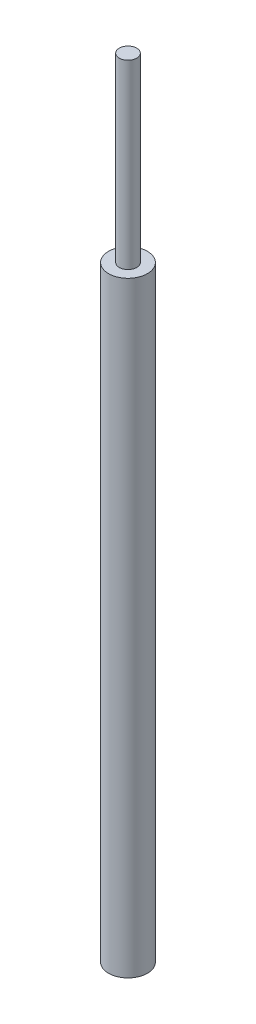
ISO-10303-21;
HEADER;
FILE_DESCRIPTION(('STEP AP214'),'2;1');
FILE_NAME('part.step','',(''),(''),'','','');
FILE_SCHEMA(('AUTOMOTIVE_DESIGN { 1 0 10303 214 1 1 1 1 }'));
ENDSEC;
DATA;
#1=APPLICATION_CONTEXT('core data for automotive mechanical design processes');
#2=APPLICATION_PROTOCOL_DEFINITION('international standard','automotive_design',2000,#1);
#3=PRODUCT_CONTEXT('',#1,'mechanical');
#4=PRODUCT('Part','Part','',(#3));
#5=PRODUCT_RELATED_PRODUCT_CATEGORY('part','',(#4));
#6=PRODUCT_DEFINITION_FORMATION('','',#4);
#7=PRODUCT_DEFINITION_CONTEXT('part definition',#1,'design');
#8=PRODUCT_DEFINITION('design','',#6,#7);
#9=PRODUCT_DEFINITION_SHAPE('','',#8);
#10=(LENGTH_UNIT() NAMED_UNIT(*) SI_UNIT(.MILLI.,.METRE.));
#11=(NAMED_UNIT(*) PLANE_ANGLE_UNIT() SI_UNIT($,.RADIAN.));
#12=(NAMED_UNIT(*) SI_UNIT($,.STERADIAN.) SOLID_ANGLE_UNIT());
#13=UNCERTAINTY_MEASURE_WITH_UNIT(LENGTH_MEASURE(1.E-05),#10,'distance_accuracy_value','');
#14=(GEOMETRIC_REPRESENTATION_CONTEXT(3) GLOBAL_UNCERTAINTY_ASSIGNED_CONTEXT((#13)) GLOBAL_UNIT_ASSIGNED_CONTEXT((#10,
#11,#12)) REPRESENTATION_CONTEXT('',''));
#15=CARTESIAN_POINT('',(0.,0.,0.));
#16=DIRECTION('',(0.,0.,1.));
#17=DIRECTION('',(1.,0.,0.));
#18=AXIS2_PLACEMENT_3D('',#15,#16,#17);
#19=CARTESIAN_POINT('',(-17.9578,-3.3782,0.5588));
#20=DIRECTION('',(0.,1.,0.));
#21=DIRECTION('',(1.,0.,0.));
#22=AXIS2_PLACEMENT_3D('',#19,#20,#21);
#23=PLANE('',#22);
#24=CARTESIAN_POINT('',(-17.9578,-3.3782,0.5588));
#25=DIRECTION('',(0.,1.,0.));
#26=DIRECTION('',(-0.693946000875941,0.,-0.720027046622756));
#27=AXIS2_PLACEMENT_3D('',#24,#25,#26);
#28=CIRCLE('',#27,0.2286);
#29=CARTESIAN_POINT('',(-17.7991639441998,-3.3782,0.723398182857962));
#30=VERTEX_POINT('',#29);
#31=EDGE_CURVE('E21',#30,#30,#28,.T.);
#32=ORIENTED_EDGE('',*,*,#31,.T.);
#33=EDGE_LOOP('',(#32));
#34=FACE_BOUND('',#33,.T.);
#35=ADVANCED_FACE('F17',(#34),#23,.T.);
#36=CARTESIAN_POINT('',(-17.9578,-24.003,0.5588));
#37=DIRECTION('',(0.,1.,0.));
#38=DIRECTION('',(1.,0.,0.));
#39=AXIS2_PLACEMENT_3D('',#36,#37,#38);
#40=PLANE('',#39);
#41=CARTESIAN_POINT('',(-17.9578,-24.003,0.5588));
#42=DIRECTION('',(0.,1.,0.));
#43=DIRECTION('',(-0.693946000875943,0.,-0.720027046622755));
#44=AXIS2_PLACEMENT_3D('',#41,#42,#43);
#45=CIRCLE('',#44,0.508);
#46=CARTESIAN_POINT('',(-17.605275431555,-24.003,0.924573739684359));
#47=VERTEX_POINT('',#46);
#48=EDGE_CURVE('E28',#47,#47,#45,.T.);
#49=ORIENTED_EDGE('',*,*,#48,.F.);
#50=EDGE_LOOP('',(#49));
#51=FACE_BOUND('',#50,.T.);
#52=ADVANCED_FACE('F75',(#51),#40,.F.);
#53=CARTESIAN_POINT('',(-17.9578,-8.128,0.5588));
#54=DIRECTION('',(0.,1.,0.));
#55=DIRECTION('',(1.,0.,0.));
#56=AXIS2_PLACEMENT_3D('',#53,#54,#55);
#57=PLANE('',#56);
#58=CARTESIAN_POINT('',(-17.9578,-8.128,0.5588));
#59=DIRECTION('',(0.,1.,0.));
#60=DIRECTION('',(-0.693946000875941,0.,-0.720027046622756));
#61=AXIS2_PLACEMENT_3D('',#58,#59,#60);
#62=CIRCLE('',#61,0.2286);
#63=CARTESIAN_POINT('',(-17.7991639441998,-8.128,0.723398182857962));
#64=VERTEX_POINT('',#63);
#65=EDGE_CURVE('E56',#64,#64,#62,.T.);
#66=ORIENTED_EDGE('',*,*,#65,.F.);
#67=EDGE_LOOP('',(#66));
#68=FACE_BOUND('',#67,.T.);
#69=CARTESIAN_POINT('',(-17.9578,-8.128,0.5588));
#70=DIRECTION('',(0.,1.,0.));
#71=DIRECTION('',(-0.693946000875943,0.,-0.720027046622755));
#72=AXIS2_PLACEMENT_3D('',#69,#70,#71);
#73=CIRCLE('',#72,0.508);
#74=CARTESIAN_POINT('',(-18.310324568445,-8.128,0.193026260315641));
#75=VERTEX_POINT('',#74);
#76=EDGE_CURVE('E11',#75,#75,#73,.T.);
#77=ORIENTED_EDGE('',*,*,#76,.T.);
#78=EDGE_LOOP('',(#77));
#79=FACE_BOUND('',#78,.T.);
#80=ADVANCED_FACE('F80',(#68,#79),#57,.T.);
#81=CARTESIAN_POINT('',(-17.9578,-24.003,0.5588));
#82=DIRECTION('',(0.,1.,0.));
#83=DIRECTION('',(-0.693946000875943,0.,-0.720027046622755));
#84=AXIS2_PLACEMENT_3D('',#81,#82,#83);
#85=CYLINDRICAL_SURFACE('',#84,0.508);
#86=ORIENTED_EDGE('',*,*,#76,.F.);
#87=EDGE_LOOP('',(#86));
#88=FACE_BOUND('',#87,.T.);
#89=ORIENTED_EDGE('',*,*,#48,.T.);
#90=EDGE_LOOP('',(#89));
#91=FACE_BOUND('',#90,.T.);
#92=ADVANCED_FACE('F102',(#88,#91),#85,.T.);
#93=CARTESIAN_POINT('',(-17.9578,-3.3782,0.5588));
#94=DIRECTION('',(0.,-1.,0.));
#95=DIRECTION('',(0.693946000875941,0.,0.720027046622756));
#96=AXIS2_PLACEMENT_3D('',#93,#94,#95);
#97=CYLINDRICAL_SURFACE('',#96,0.2286);
#98=ORIENTED_EDGE('',*,*,#65,.T.);
#99=EDGE_LOOP('',(#98));
#100=FACE_BOUND('',#99,.T.);
#101=ORIENTED_EDGE('',*,*,#31,.F.);
#102=EDGE_LOOP('',(#101));
#103=FACE_BOUND('',#102,.T.);
#104=ADVANCED_FACE('F19',(#100,#103),#97,.T.);
#105=CLOSED_SHELL('',(#35,#52,#80,#92,#104));
#106=MANIFOLD_SOLID_BREP('B1',#105);
#107=ADVANCED_BREP_SHAPE_REPRESENTATION('',(#18,#106),#14);
#108=SHAPE_DEFINITION_REPRESENTATION(#9,#107);
ENDSEC;
END-ISO-10303-21;
